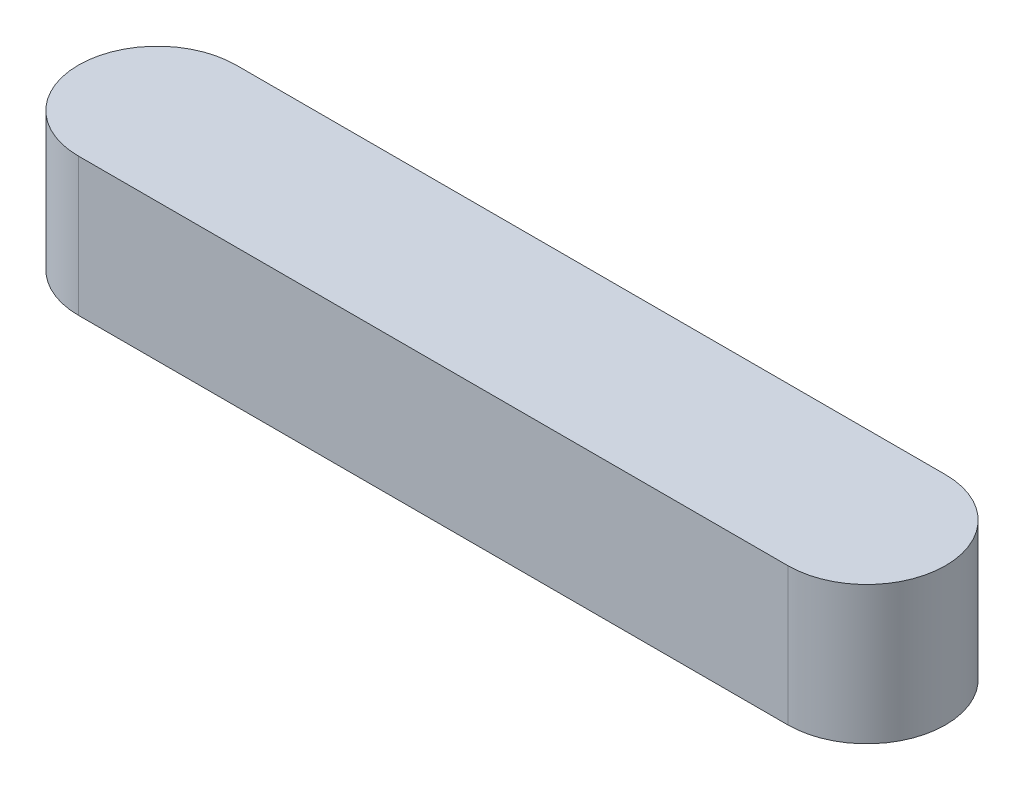
ISO-10303-21;
HEADER;
FILE_DESCRIPTION(('STEP AP214'),'2;1');
FILE_NAME('part.step','',(''),(''),'','','');
FILE_SCHEMA(('AUTOMOTIVE_DESIGN { 1 0 10303 214 1 1 1 1 }'));
ENDSEC;
DATA;
#1=APPLICATION_CONTEXT('core data for automotive mechanical design processes');
#2=APPLICATION_PROTOCOL_DEFINITION('international standard','automotive_design',2000,#1);
#3=PRODUCT_CONTEXT('',#1,'mechanical');
#4=PRODUCT('Part','Part','',(#3));
#5=PRODUCT_RELATED_PRODUCT_CATEGORY('part','',(#4));
#6=PRODUCT_DEFINITION_FORMATION('','',#4);
#7=PRODUCT_DEFINITION_CONTEXT('part definition',#1,'design');
#8=PRODUCT_DEFINITION('design','',#6,#7);
#9=PRODUCT_DEFINITION_SHAPE('','',#8);
#10=(LENGTH_UNIT() NAMED_UNIT(*) SI_UNIT(.MILLI.,.METRE.));
#11=(NAMED_UNIT(*) PLANE_ANGLE_UNIT() SI_UNIT($,.RADIAN.));
#12=(NAMED_UNIT(*) SI_UNIT($,.STERADIAN.) SOLID_ANGLE_UNIT());
#13=UNCERTAINTY_MEASURE_WITH_UNIT(LENGTH_MEASURE(1.E-05),#10,'distance_accuracy_value','');
#14=(GEOMETRIC_REPRESENTATION_CONTEXT(3) GLOBAL_UNCERTAINTY_ASSIGNED_CONTEXT((#13)) GLOBAL_UNIT_ASSIGNED_CONTEXT((#10,
#11,#12)) REPRESENTATION_CONTEXT('',''));
#15=CARTESIAN_POINT('',(0.,0.,0.));
#16=DIRECTION('',(0.,0.,1.));
#17=DIRECTION('',(1.,0.,0.));
#18=AXIS2_PLACEMENT_3D('',#15,#16,#17);
#19=CARTESIAN_POINT('',(-9.,3.5,0.));
#20=DIRECTION('',(0.,-1.,0.));
#21=DIRECTION('',(0.,0.,-1.));
#22=AXIS2_PLACEMENT_3D('',#19,#20,#21);
#23=CYLINDRICAL_SURFACE('',#22,2.);
#24=CARTESIAN_POINT('',(-9.,0.,0.));
#25=DIRECTION('',(0.,1.,0.));
#26=DIRECTION('',(0.,0.,1.));
#27=AXIS2_PLACEMENT_3D('',#24,#25,#26);
#28=CIRCLE('',#27,2.);
#29=CARTESIAN_POINT('',(-9.,0.,-2.));
#30=VERTEX_POINT('',#29);
#31=CARTESIAN_POINT('',(-9.,0.,2.));
#32=VERTEX_POINT('',#31);
#33=EDGE_CURVE('E106',#30,#32,#28,.T.);
#34=ORIENTED_EDGE('',*,*,#33,.T.);
#35=DIRECTION('',(0.,-1.,0.));
#36=VECTOR('',#35,1.);
#37=CARTESIAN_POINT('',(-9.,3.5,2.));
#38=LINE('',#37,#36);
#39=CARTESIAN_POINT('',(-9.,3.5,2.));
#40=VERTEX_POINT('',#39);
#41=EDGE_CURVE('E11',#40,#32,#38,.T.);
#42=ORIENTED_EDGE('',*,*,#41,.F.);
#43=CARTESIAN_POINT('',(-9.,3.5,0.));
#44=DIRECTION('',(0.,1.,0.));
#45=DIRECTION('',(0.,0.,1.));
#46=AXIS2_PLACEMENT_3D('',#43,#44,#45);
#47=CIRCLE('',#46,2.);
#48=CARTESIAN_POINT('',(-9.,3.5,-2.));
#49=VERTEX_POINT('',#48);
#50=EDGE_CURVE('E94',#49,#40,#47,.T.);
#51=ORIENTED_EDGE('',*,*,#50,.F.);
#52=DIRECTION('',(0.,-1.,0.));
#53=VECTOR('',#52,1.);
#54=CARTESIAN_POINT('',(-9.,3.5,-2.));
#55=LINE('',#54,#53);
#56=EDGE_CURVE('E102',#49,#30,#55,.T.);
#57=ORIENTED_EDGE('',*,*,#56,.T.);
#58=EDGE_LOOP('',(#34,#42,#51,#57));
#59=FACE_BOUND('',#58,.T.);
#60=ADVANCED_FACE('F43',(#59),#23,.T.);
#61=CARTESIAN_POINT('',(-9.,3.5,2.));
#62=DIRECTION('',(0.,0.,-1.));
#63=DIRECTION('',(-1.,0.,0.));
#64=AXIS2_PLACEMENT_3D('',#61,#62,#63);
#65=PLANE('',#64);
#66=DIRECTION('',(1.,0.,0.));
#67=VECTOR('',#66,1.);
#68=CARTESIAN_POINT('',(-9.,0.,2.));
#69=LINE('',#68,#67);
#70=CARTESIAN_POINT('',(9.,0.,2.));
#71=VERTEX_POINT('',#70);
#72=EDGE_CURVE('E98',#32,#71,#69,.T.);
#73=ORIENTED_EDGE('',*,*,#72,.T.);
#74=DIRECTION('',(0.,-1.,0.));
#75=VECTOR('',#74,1.);
#76=CARTESIAN_POINT('',(9.,3.5,2.));
#77=LINE('',#76,#75);
#78=CARTESIAN_POINT('',(9.,3.5,2.));
#79=VERTEX_POINT('',#78);
#80=EDGE_CURVE('E51',#79,#71,#77,.T.);
#81=ORIENTED_EDGE('',*,*,#80,.F.);
#82=DIRECTION('',(1.,0.,0.));
#83=VECTOR('',#82,1.);
#84=CARTESIAN_POINT('',(-9.,3.5,2.));
#85=LINE('',#84,#83);
#86=EDGE_CURVE('E89',#40,#79,#85,.T.);
#87=ORIENTED_EDGE('',*,*,#86,.F.);
#88=ORIENTED_EDGE('',*,*,#41,.T.);
#89=EDGE_LOOP('',(#73,#81,#87,#88));
#90=FACE_BOUND('',#89,.T.);
#91=ADVANCED_FACE('F97',(#90),#65,.F.);
#92=CARTESIAN_POINT('',(9.,3.5,0.));
#93=DIRECTION('',(0.,-1.,0.));
#94=DIRECTION('',(0.,0.,-1.));
#95=AXIS2_PLACEMENT_3D('',#92,#93,#94);
#96=CYLINDRICAL_SURFACE('',#95,2.);
#97=CARTESIAN_POINT('',(9.,0.,0.));
#98=DIRECTION('',(0.,1.,0.));
#99=DIRECTION('',(0.,0.,1.));
#100=AXIS2_PLACEMENT_3D('',#97,#98,#99);
#101=CIRCLE('',#100,2.);
#102=CARTESIAN_POINT('',(9.,0.,-2.));
#103=VERTEX_POINT('',#102);
#104=EDGE_CURVE('E76',#71,#103,#101,.T.);
#105=ORIENTED_EDGE('',*,*,#104,.T.);
#106=DIRECTION('',(0.,-1.,0.));
#107=VECTOR('',#106,1.);
#108=CARTESIAN_POINT('',(9.,3.5,-2.));
#109=LINE('',#108,#107);
#110=CARTESIAN_POINT('',(9.,3.5,-2.));
#111=VERTEX_POINT('',#110);
#112=EDGE_CURVE('E99',#111,#103,#109,.T.);
#113=ORIENTED_EDGE('',*,*,#112,.F.);
#114=CARTESIAN_POINT('',(9.,3.5,0.));
#115=DIRECTION('',(0.,1.,0.));
#116=DIRECTION('',(0.,0.,1.));
#117=AXIS2_PLACEMENT_3D('',#114,#115,#116);
#118=CIRCLE('',#117,2.);
#119=EDGE_CURVE('E92',#79,#111,#118,.T.);
#120=ORIENTED_EDGE('',*,*,#119,.F.);
#121=ORIENTED_EDGE('',*,*,#80,.T.);
#122=EDGE_LOOP('',(#105,#113,#120,#121));
#123=FACE_BOUND('',#122,.T.);
#124=ADVANCED_FACE('F100',(#123),#96,.T.);
#125=CARTESIAN_POINT('',(-9.,3.5,-2.));
#126=DIRECTION('',(0.,0.,1.));
#127=DIRECTION('',(1.,0.,0.));
#128=AXIS2_PLACEMENT_3D('',#125,#126,#127);
#129=PLANE('',#128);
#130=DIRECTION('',(-1.,0.,0.));
#131=VECTOR('',#130,1.);
#132=CARTESIAN_POINT('',(-9.,0.,-2.));
#133=LINE('',#132,#131);
#134=EDGE_CURVE('E82',#103,#30,#133,.T.);
#135=ORIENTED_EDGE('',*,*,#134,.T.);
#136=ORIENTED_EDGE('',*,*,#56,.F.);
#137=DIRECTION('',(-1.,0.,0.));
#138=VECTOR('',#137,1.);
#139=CARTESIAN_POINT('',(-9.,3.5,-2.));
#140=LINE('',#139,#138);
#141=EDGE_CURVE('E59',#111,#49,#140,.T.);
#142=ORIENTED_EDGE('',*,*,#141,.F.);
#143=ORIENTED_EDGE('',*,*,#112,.T.);
#144=EDGE_LOOP('',(#135,#136,#142,#143));
#145=FACE_BOUND('',#144,.T.);
#146=ADVANCED_FACE('F113',(#145),#129,.F.);
#147=CARTESIAN_POINT('',(-9.,3.5,0.));
#148=DIRECTION('',(0.,1.,0.));
#149=DIRECTION('',(0.,0.,1.));
#150=AXIS2_PLACEMENT_3D('',#147,#148,#149);
#151=PLANE('',#150);
#152=ORIENTED_EDGE('',*,*,#50,.T.);
#153=ORIENTED_EDGE('',*,*,#86,.T.);
#154=ORIENTED_EDGE('',*,*,#119,.T.);
#155=ORIENTED_EDGE('',*,*,#141,.T.);
#156=EDGE_LOOP('',(#152,#153,#154,#155));
#157=FACE_BOUND('',#156,.T.);
#158=ADVANCED_FACE('F90',(#157),#151,.T.);
#159=CARTESIAN_POINT('',(-9.,0.,0.));
#160=DIRECTION('',(0.,1.,0.));
#161=DIRECTION('',(0.,0.,1.));
#162=AXIS2_PLACEMENT_3D('',#159,#160,#161);
#163=PLANE('',#162);
#164=ORIENTED_EDGE('',*,*,#33,.F.);
#165=ORIENTED_EDGE('',*,*,#134,.F.);
#166=ORIENTED_EDGE('',*,*,#104,.F.);
#167=ORIENTED_EDGE('',*,*,#72,.F.);
#168=EDGE_LOOP('',(#164,#165,#166,#167));
#169=FACE_BOUND('',#168,.T.);
#170=ADVANCED_FACE('F116',(#169),#163,.F.);
#171=CLOSED_SHELL('',(#60,#91,#124,#146,#158,#170));
#172=MANIFOLD_SOLID_BREP('B2',#171);
#173=ADVANCED_BREP_SHAPE_REPRESENTATION('',(#18,#172),#14);
#174=SHAPE_DEFINITION_REPRESENTATION(#9,#173);
ENDSEC;
END-ISO-10303-21;
